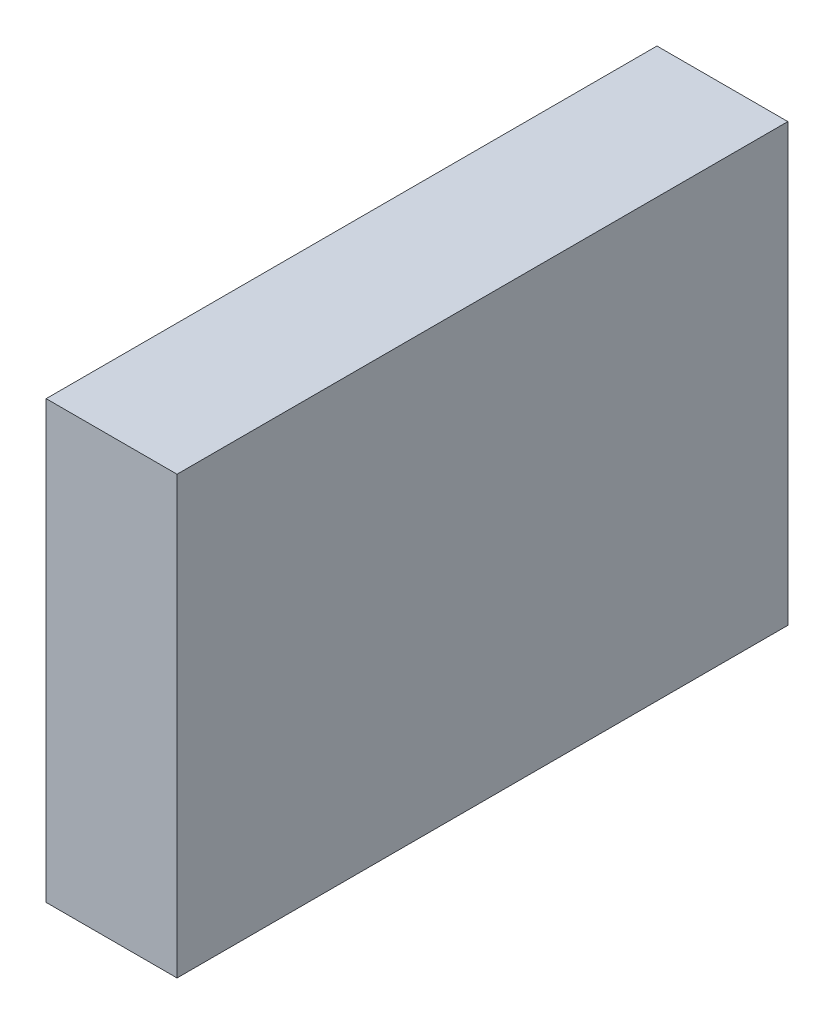
ISO-10303-21;
HEADER;
FILE_DESCRIPTION(('STEP AP214'),'2;1');
FILE_NAME('part.step','',(''),(''),'','','');
FILE_SCHEMA(('AUTOMOTIVE_DESIGN { 1 0 10303 214 1 1 1 1 }'));
ENDSEC;
DATA;
#1=APPLICATION_CONTEXT('core data for automotive mechanical design processes');
#2=APPLICATION_PROTOCOL_DEFINITION('international standard','automotive_design',2000,#1);
#3=PRODUCT_CONTEXT('',#1,'mechanical');
#4=PRODUCT('Part','Part','',(#3));
#5=PRODUCT_RELATED_PRODUCT_CATEGORY('part','',(#4));
#6=PRODUCT_DEFINITION_FORMATION('','',#4);
#7=PRODUCT_DEFINITION_CONTEXT('part definition',#1,'design');
#8=PRODUCT_DEFINITION('design','',#6,#7);
#9=PRODUCT_DEFINITION_SHAPE('','',#8);
#10=(LENGTH_UNIT() NAMED_UNIT(*) SI_UNIT(.MILLI.,.METRE.));
#11=(NAMED_UNIT(*) PLANE_ANGLE_UNIT() SI_UNIT($,.RADIAN.));
#12=(NAMED_UNIT(*) SI_UNIT($,.STERADIAN.) SOLID_ANGLE_UNIT());
#13=UNCERTAINTY_MEASURE_WITH_UNIT(LENGTH_MEASURE(1.E-05),#10,'distance_accuracy_value','');
#14=(GEOMETRIC_REPRESENTATION_CONTEXT(3) GLOBAL_UNCERTAINTY_ASSIGNED_CONTEXT((#13)) GLOBAL_UNIT_ASSIGNED_CONTEXT((#10,
#11,#12)) REPRESENTATION_CONTEXT('',''));
#15=CARTESIAN_POINT('',(0.,0.,0.));
#16=DIRECTION('',(0.,0.,1.));
#17=DIRECTION('',(1.,0.,0.));
#18=AXIS2_PLACEMENT_3D('',#15,#16,#17);
#19=CARTESIAN_POINT('',(-3.9,0.679999822530764,-3.72112146154861));
#20=DIRECTION('',(1.,0.,0.));
#21=DIRECTION('',(0.,1.,8.74227765734759E-08));
#22=AXIS2_PLACEMENT_3D('',#19,#20,#21);
#23=PLANE('',#22);
#24=DIRECTION('',(0.,-0.999999999999996,-8.74227765733007E-08));
#25=VECTOR('',#24,1.);
#26=CARTESIAN_POINT('',(-3.9,1.74999969402028,-2.25112136800623));
#27=LINE('',#26,#25);
#28=CARTESIAN_POINT('',(-3.9,1.74999969401928,-2.25112136800623));
#29=VERTEX_POINT('',#28);
#30=CARTESIAN_POINT('',(-3.9,0.749999694018282,-2.25112145543001));
#31=VERTEX_POINT('',#30);
#32=EDGE_CURVE('E11',#29,#31,#27,.T.);
#33=ORIENTED_EDGE('',*,*,#32,.T.);
#34=DIRECTION('',(0.,8.74227765576152E-08,-0.999999999999996));
#35=VECTOR('',#34,1.);
#36=CARTESIAN_POINT('',(-3.9,0.749999694018282,-2.25112145542901));
#37=LINE('',#36,#35);
#38=CARTESIAN_POINT('',(-3.9,0.749999816411169,-3.65112145542901));
#39=VERTEX_POINT('',#38);
#40=EDGE_CURVE('E69',#31,#39,#37,.T.);
#41=ORIENTED_EDGE('',*,*,#40,.T.);
#42=DIRECTION('',(0.,0.999999999999996,8.74227765733007E-08));
#43=VECTOR('',#42,1.);
#44=CARTESIAN_POINT('',(-3.9,0.749999816410169,-3.65112145542901));
#45=LINE('',#44,#43);
#46=CARTESIAN_POINT('',(-3.9,1.74999981641217,-3.65112136800523));
#47=VERTEX_POINT('',#46);
#48=EDGE_CURVE('E55',#39,#47,#45,.T.);
#49=ORIENTED_EDGE('',*,*,#48,.T.);
#50=DIRECTION('',(0.,-8.74227764783136E-08,0.999999999999996));
#51=VECTOR('',#50,1.);
#52=CARTESIAN_POINT('',(-3.9,1.74999981641217,-3.65112136800623));
#53=LINE('',#52,#51);
#54=EDGE_CURVE('E53',#47,#29,#53,.T.);
#55=ORIENTED_EDGE('',*,*,#54,.T.);
#56=EDGE_LOOP('',(#33,#41,#49,#55));
#57=FACE_BOUND('',#56,.T.);
#58=ADVANCED_FACE('F17',(#57),#23,.T.);
#59=CARTESIAN_POINT('',(-4.2,0.679999822530764,-3.72112146154861));
#60=DIRECTION('',(1.,0.,0.));
#61=DIRECTION('',(0.,1.,8.74227765734759E-08));
#62=AXIS2_PLACEMENT_3D('',#59,#60,#61);
#63=PLANE('',#62);
#64=DIRECTION('',(0.,-8.74227766369168E-08,0.999999999999996));
#65=VECTOR('',#64,1.);
#66=CARTESIAN_POINT('',(-4.2,1.74999981641217,-3.65112136800624));
#67=LINE('',#66,#65);
#68=CARTESIAN_POINT('',(-4.2,1.74999981641217,-3.65112136800523));
#69=VERTEX_POINT('',#68);
#70=CARTESIAN_POINT('',(-4.2,1.74999969401928,-2.25112136800623));
#71=VERTEX_POINT('',#70);
#72=EDGE_CURVE('E24',#69,#71,#67,.T.);
#73=ORIENTED_EDGE('',*,*,#72,.F.);
#74=DIRECTION('',(0.,0.999999999999996,8.74227765733007E-08));
#75=VECTOR('',#74,1.);
#76=CARTESIAN_POINT('',(-4.2,0.749999816410169,-3.65112145542901));
#77=LINE('',#76,#75);
#78=CARTESIAN_POINT('',(-4.2,0.749999816411169,-3.65112145542901));
#79=VERTEX_POINT('',#78);
#80=EDGE_CURVE('E70',#79,#69,#77,.T.);
#81=ORIENTED_EDGE('',*,*,#80,.F.);
#82=DIRECTION('',(0.,8.74227765576152E-08,-0.999999999999996));
#83=VECTOR('',#82,1.);
#84=CARTESIAN_POINT('',(-4.2,0.749999694018282,-2.25112145542901));
#85=LINE('',#84,#83);
#86=CARTESIAN_POINT('',(-4.2,0.749999694018282,-2.25112145543001));
#87=VERTEX_POINT('',#86);
#88=EDGE_CURVE('E59',#87,#79,#85,.T.);
#89=ORIENTED_EDGE('',*,*,#88,.F.);
#90=DIRECTION('',(0.,-0.999999999999996,-8.74227765733007E-08));
#91=VECTOR('',#90,1.);
#92=CARTESIAN_POINT('',(-4.2,1.74999969402028,-2.25112136800623));
#93=LINE('',#92,#91);
#94=EDGE_CURVE('E78',#71,#87,#93,.T.);
#95=ORIENTED_EDGE('',*,*,#94,.F.);
#96=EDGE_LOOP('',(#73,#81,#89,#95));
#97=FACE_BOUND('',#96,.T.);
#98=ADVANCED_FACE('F89',(#97),#63,.F.);
#99=CARTESIAN_POINT('',(-3.9,1.74999969402028,-2.25112136800623));
#100=DIRECTION('',(0.,8.74227765734759E-08,-1.));
#101=DIRECTION('',(0.,-1.,-8.74227765734759E-08));
#102=AXIS2_PLACEMENT_3D('',#99,#100,#101);
#103=PLANE('',#102);
#104=DIRECTION('',(-1.,0.,0.));
#105=VECTOR('',#104,1.);
#106=CARTESIAN_POINT('',(-3.9,1.74999969402028,-2.25112136800623));
#107=LINE('',#106,#105);
#108=EDGE_CURVE('E65',#29,#71,#107,.T.);
#109=ORIENTED_EDGE('',*,*,#108,.T.);
#110=ORIENTED_EDGE('',*,*,#94,.T.);
#111=DIRECTION('',(-1.,0.,0.));
#112=VECTOR('',#111,1.);
#113=CARTESIAN_POINT('',(-3.9,0.749999694018282,-2.25112145542901));
#114=LINE('',#113,#112);
#115=EDGE_CURVE('E66',#31,#87,#114,.T.);
#116=ORIENTED_EDGE('',*,*,#115,.F.);
#117=ORIENTED_EDGE('',*,*,#32,.F.);
#118=EDGE_LOOP('',(#109,#110,#116,#117));
#119=FACE_BOUND('',#118,.T.);
#120=ADVANCED_FACE('F63',(#119),#103,.F.);
#121=CARTESIAN_POINT('',(-3.9,0.749999694018282,-2.25112145542901));
#122=DIRECTION('',(0.,1.,8.74227765734759E-08));
#123=DIRECTION('',(0.,8.74227765734759E-08,-1.));
#124=AXIS2_PLACEMENT_3D('',#121,#122,#123);
#125=PLANE('',#124);
#126=ORIENTED_EDGE('',*,*,#115,.T.);
#127=ORIENTED_EDGE('',*,*,#88,.T.);
#128=DIRECTION('',(-1.,0.,0.));
#129=VECTOR('',#128,1.);
#130=CARTESIAN_POINT('',(-3.9,0.749999816410169,-3.65112145542901));
#131=LINE('',#130,#129);
#132=EDGE_CURVE('E60',#39,#79,#131,.T.);
#133=ORIENTED_EDGE('',*,*,#132,.F.);
#134=ORIENTED_EDGE('',*,*,#40,.F.);
#135=EDGE_LOOP('',(#126,#127,#133,#134));
#136=FACE_BOUND('',#135,.T.);
#137=ADVANCED_FACE('F91',(#136),#125,.F.);
#138=CARTESIAN_POINT('',(-3.9,0.749999816410169,-3.65112145542901));
#139=DIRECTION('',(0.,-8.74227765734759E-08,1.));
#140=DIRECTION('',(0.,1.,8.74227765734759E-08));
#141=AXIS2_PLACEMENT_3D('',#138,#139,#140);
#142=PLANE('',#141);
#143=ORIENTED_EDGE('',*,*,#132,.T.);
#144=ORIENTED_EDGE('',*,*,#80,.T.);
#145=DIRECTION('',(-1.,0.,0.));
#146=VECTOR('',#145,1.);
#147=CARTESIAN_POINT('',(-3.9,1.74999981641217,-3.65112136800624));
#148=LINE('',#147,#146);
#149=EDGE_CURVE('E84',#47,#69,#148,.T.);
#150=ORIENTED_EDGE('',*,*,#149,.F.);
#151=ORIENTED_EDGE('',*,*,#48,.F.);
#152=EDGE_LOOP('',(#143,#144,#150,#151));
#153=FACE_BOUND('',#152,.T.);
#154=ADVANCED_FACE('F86',(#153),#142,.F.);
#155=CARTESIAN_POINT('',(-3.9,1.74999981641217,-3.65112136800623));
#156=DIRECTION('',(0.,-1.,-8.74227765734759E-08));
#157=DIRECTION('',(0.,-8.74227765734759E-08,1.));
#158=AXIS2_PLACEMENT_3D('',#155,#156,#157);
#159=PLANE('',#158);
#160=ORIENTED_EDGE('',*,*,#149,.T.);
#161=ORIENTED_EDGE('',*,*,#72,.T.);
#162=ORIENTED_EDGE('',*,*,#108,.F.);
#163=ORIENTED_EDGE('',*,*,#54,.F.);
#164=EDGE_LOOP('',(#160,#161,#162,#163));
#165=FACE_BOUND('',#164,.T.);
#166=ADVANCED_FACE('F68',(#165),#159,.F.);
#167=CLOSED_SHELL('',(#58,#98,#120,#137,#154,#166));
#168=MANIFOLD_SOLID_BREP('B1',#167);
#169=ADVANCED_BREP_SHAPE_REPRESENTATION('',(#18,#168),#14);
#170=SHAPE_DEFINITION_REPRESENTATION(#9,#169);
ENDSEC;
END-ISO-10303-21;
